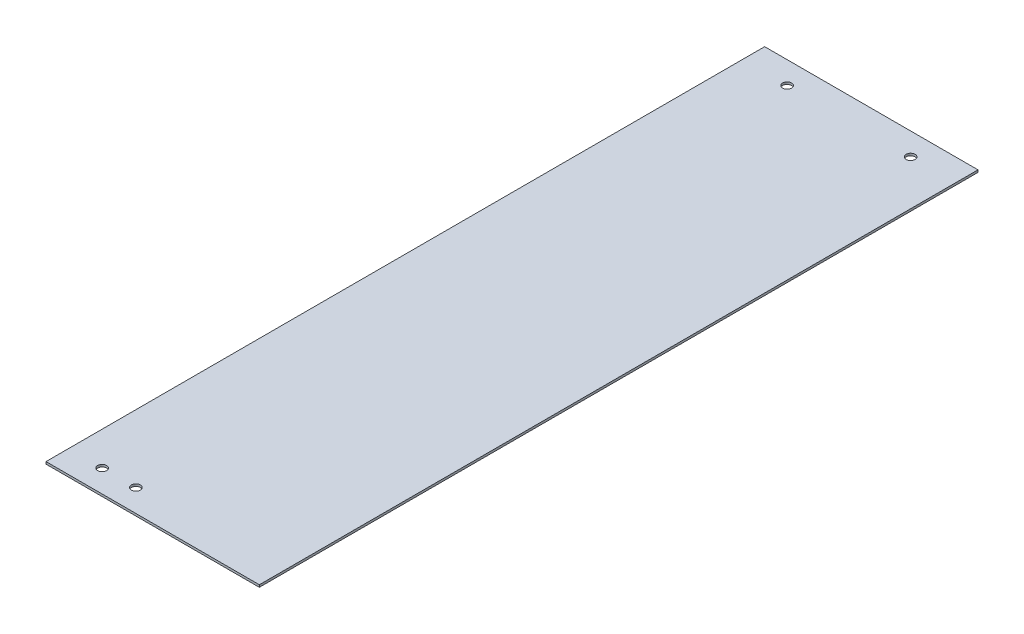
ISO-10303-21;
HEADER;
FILE_DESCRIPTION(('STEP AP214'),'2;1');
FILE_NAME('part.step','',(''),(''),'','','');
FILE_SCHEMA(('AUTOMOTIVE_DESIGN { 1 0 10303 214 1 1 1 1 }'));
ENDSEC;
DATA;
#1=APPLICATION_CONTEXT('core data for automotive mechanical design processes');
#2=APPLICATION_PROTOCOL_DEFINITION('international standard','automotive_design',2000,#1);
#3=PRODUCT_CONTEXT('',#1,'mechanical');
#4=PRODUCT('Part','Part','',(#3));
#5=PRODUCT_RELATED_PRODUCT_CATEGORY('part','',(#4));
#6=PRODUCT_DEFINITION_FORMATION('','',#4);
#7=PRODUCT_DEFINITION_CONTEXT('part definition',#1,'design');
#8=PRODUCT_DEFINITION('design','',#6,#7);
#9=PRODUCT_DEFINITION_SHAPE('','',#8);
#10=(LENGTH_UNIT() NAMED_UNIT(*) SI_UNIT(.MILLI.,.METRE.));
#11=(NAMED_UNIT(*) PLANE_ANGLE_UNIT() SI_UNIT($,.RADIAN.));
#12=(NAMED_UNIT(*) SI_UNIT($,.STERADIAN.) SOLID_ANGLE_UNIT());
#13=UNCERTAINTY_MEASURE_WITH_UNIT(LENGTH_MEASURE(1.E-05),#10,'distance_accuracy_value','');
#14=(GEOMETRIC_REPRESENTATION_CONTEXT(3) GLOBAL_UNCERTAINTY_ASSIGNED_CONTEXT((#13)) GLOBAL_UNIT_ASSIGNED_CONTEXT((#10,
#11,#12)) REPRESENTATION_CONTEXT('',''));
#15=CARTESIAN_POINT('',(0.,0.,0.));
#16=DIRECTION('',(0.,0.,1.));
#17=DIRECTION('',(1.,0.,0.));
#18=AXIS2_PLACEMENT_3D('',#15,#16,#17);
#19=CARTESIAN_POINT('',(0.,1.,0.));
#20=DIRECTION('',(0.,1.,0.));
#21=DIRECTION('',(0.,0.,1.));
#22=AXIS2_PLACEMENT_3D('',#19,#20,#21);
#23=PLANE('',#22);
#24=CARTESIAN_POINT('',(-32.5000000000001,1.,150.));
#25=DIRECTION('',(0.,1.,0.));
#26=DIRECTION('',(0.,0.,1.));
#27=AXIS2_PLACEMENT_3D('',#24,#25,#26);
#28=CIRCLE('',#27,2.);
#29=CARTESIAN_POINT('',(-32.5000000000001,1.,152.));
#30=VERTEX_POINT('',#29);
#31=EDGE_CURVE('E141',#30,#30,#28,.T.);
#32=ORIENTED_EDGE('',*,*,#31,.F.);
#33=EDGE_LOOP('',(#32));
#34=FACE_BOUND('',#33,.T.);
#35=CARTESIAN_POINT('',(-17.5000000000001,1.,150.));
#36=DIRECTION('',(0.,1.,0.));
#37=DIRECTION('',(0.,0.,1.));
#38=AXIS2_PLACEMENT_3D('',#35,#36,#37);
#39=CIRCLE('',#38,2.);
#40=CARTESIAN_POINT('',(-17.5000000000001,1.,152.));
#41=VERTEX_POINT('',#40);
#42=EDGE_CURVE('E148',#41,#41,#39,.T.);
#43=ORIENTED_EDGE('',*,*,#42,.F.);
#44=EDGE_LOOP('',(#43));
#45=FACE_BOUND('',#44,.T.);
#46=CARTESIAN_POINT('',(-27.5000000000001,1.,-150.));
#47=DIRECTION('',(0.,1.,0.));
#48=DIRECTION('',(0.,0.,1.));
#49=AXIS2_PLACEMENT_3D('',#46,#47,#48);
#50=CIRCLE('',#49,2.00000000000001);
#51=CARTESIAN_POINT('',(-27.5000000000001,1.,-148.));
#52=VERTEX_POINT('',#51);
#53=EDGE_CURVE('E111',#52,#52,#50,.T.);
#54=ORIENTED_EDGE('',*,*,#53,.F.);
#55=EDGE_LOOP('',(#54));
#56=FACE_BOUND('',#55,.T.);
#57=DIRECTION('',(0.,0.,-1.));
#58=VECTOR('',#57,1.);
#59=CARTESIAN_POINT('',(47.5,1.,-160.));
#60=LINE('',#59,#58);
#61=CARTESIAN_POINT('',(47.5000000000001,1.,160.));
#62=VERTEX_POINT('',#61);
#63=CARTESIAN_POINT('',(47.5,1.,-160.));
#64=VERTEX_POINT('',#63);
#65=EDGE_CURVE('E91',#62,#64,#60,.T.);
#66=ORIENTED_EDGE('',*,*,#65,.T.);
#67=DIRECTION('',(-1.,0.,0.));
#68=VECTOR('',#67,1.);
#69=CARTESIAN_POINT('',(-47.5000000000001,1.,-160.));
#70=LINE('',#69,#68);
#71=CARTESIAN_POINT('',(-47.5000000000001,1.,-160.));
#72=VERTEX_POINT('',#71);
#73=EDGE_CURVE('E86',#64,#72,#70,.T.);
#74=ORIENTED_EDGE('',*,*,#73,.T.);
#75=DIRECTION('',(0.,0.,1.));
#76=VECTOR('',#75,1.);
#77=CARTESIAN_POINT('',(-47.5000000000001,1.,-160.));
#78=LINE('',#77,#76);
#79=CARTESIAN_POINT('',(-47.5,1.,160.));
#80=VERTEX_POINT('',#79);
#81=EDGE_CURVE('E89',#72,#80,#78,.T.);
#82=ORIENTED_EDGE('',*,*,#81,.T.);
#83=DIRECTION('',(1.,0.,0.));
#84=VECTOR('',#83,1.);
#85=CARTESIAN_POINT('',(-47.5,1.,160.));
#86=LINE('',#85,#84);
#87=EDGE_CURVE('E56',#80,#62,#86,.T.);
#88=ORIENTED_EDGE('',*,*,#87,.T.);
#89=EDGE_LOOP('',(#66,#74,#82,#88));
#90=FACE_BOUND('',#89,.T.);
#91=CARTESIAN_POINT('',(27.5000000000001,1.,-150.));
#92=DIRECTION('',(0.,1.,0.));
#93=DIRECTION('',(0.,0.,-1.));
#94=AXIS2_PLACEMENT_3D('',#91,#92,#93);
#95=CIRCLE('',#94,2.00000000000001);
#96=CARTESIAN_POINT('',(27.5000000000001,1.,-152.));
#97=VERTEX_POINT('',#96);
#98=EDGE_CURVE('E133',#97,#97,#95,.T.);
#99=ORIENTED_EDGE('',*,*,#98,.F.);
#100=EDGE_LOOP('',(#99));
#101=FACE_BOUND('',#100,.T.);
#102=ADVANCED_FACE('F38',(#34,#45,#56,#90,#101),#23,.T.);
#103=CARTESIAN_POINT('',(0.,0.,0.));
#104=DIRECTION('',(0.,1.,0.));
#105=DIRECTION('',(0.,0.,1.));
#106=AXIS2_PLACEMENT_3D('',#103,#104,#105);
#107=PLANE('',#106);
#108=CARTESIAN_POINT('',(-32.5000000000001,0.,150.));
#109=DIRECTION('',(0.,1.,0.));
#110=DIRECTION('',(0.,0.,1.));
#111=AXIS2_PLACEMENT_3D('',#108,#109,#110);
#112=CIRCLE('',#111,2.);
#113=CARTESIAN_POINT('',(-32.5000000000001,0.,152.));
#114=VERTEX_POINT('',#113);
#115=EDGE_CURVE('E152',#114,#114,#112,.T.);
#116=ORIENTED_EDGE('',*,*,#115,.T.);
#117=EDGE_LOOP('',(#116));
#118=FACE_BOUND('',#117,.T.);
#119=CARTESIAN_POINT('',(-17.5000000000001,0.,150.));
#120=DIRECTION('',(0.,1.,0.));
#121=DIRECTION('',(0.,0.,1.));
#122=AXIS2_PLACEMENT_3D('',#119,#120,#121);
#123=CIRCLE('',#122,2.);
#124=CARTESIAN_POINT('',(-17.5000000000001,0.,152.));
#125=VERTEX_POINT('',#124);
#126=EDGE_CURVE('E153',#125,#125,#123,.T.);
#127=ORIENTED_EDGE('',*,*,#126,.T.);
#128=EDGE_LOOP('',(#127));
#129=FACE_BOUND('',#128,.T.);
#130=DIRECTION('',(0.,0.,-1.));
#131=VECTOR('',#130,1.);
#132=CARTESIAN_POINT('',(47.5,0.,-160.));
#133=LINE('',#132,#131);
#134=CARTESIAN_POINT('',(47.5000000000001,0.,160.));
#135=VERTEX_POINT('',#134);
#136=CARTESIAN_POINT('',(47.5,0.,-160.));
#137=VERTEX_POINT('',#136);
#138=EDGE_CURVE('E107',#135,#137,#133,.T.);
#139=ORIENTED_EDGE('',*,*,#138,.F.);
#140=DIRECTION('',(1.,0.,0.));
#141=VECTOR('',#140,1.);
#142=CARTESIAN_POINT('',(-47.5,0.,160.));
#143=LINE('',#142,#141);
#144=CARTESIAN_POINT('',(-47.5,0.,160.));
#145=VERTEX_POINT('',#144);
#146=EDGE_CURVE('E79',#145,#135,#143,.T.);
#147=ORIENTED_EDGE('',*,*,#146,.F.);
#148=DIRECTION('',(0.,0.,1.));
#149=VECTOR('',#148,1.);
#150=CARTESIAN_POINT('',(-47.5000000000001,0.,-160.));
#151=LINE('',#150,#149);
#152=CARTESIAN_POINT('',(-47.5000000000001,0.,-160.));
#153=VERTEX_POINT('',#152);
#154=EDGE_CURVE('E73',#153,#145,#151,.T.);
#155=ORIENTED_EDGE('',*,*,#154,.F.);
#156=DIRECTION('',(-1.,0.,0.));
#157=VECTOR('',#156,1.);
#158=CARTESIAN_POINT('',(-47.5000000000001,0.,-160.));
#159=LINE('',#158,#157);
#160=EDGE_CURVE('E96',#137,#153,#159,.T.);
#161=ORIENTED_EDGE('',*,*,#160,.F.);
#162=EDGE_LOOP('',(#139,#147,#155,#161));
#163=FACE_BOUND('',#162,.T.);
#164=CARTESIAN_POINT('',(-27.5000000000001,0.,-150.));
#165=DIRECTION('',(0.,1.,0.));
#166=DIRECTION('',(0.,0.,1.));
#167=AXIS2_PLACEMENT_3D('',#164,#165,#166);
#168=CIRCLE('',#167,2.00000000000001);
#169=CARTESIAN_POINT('',(-27.5000000000001,0.,-148.));
#170=VERTEX_POINT('',#169);
#171=EDGE_CURVE('E129',#170,#170,#168,.T.);
#172=ORIENTED_EDGE('',*,*,#171,.T.);
#173=EDGE_LOOP('',(#172));
#174=FACE_BOUND('',#173,.T.);
#175=CARTESIAN_POINT('',(27.5000000000001,0.,-150.));
#176=DIRECTION('',(0.,1.,0.));
#177=DIRECTION('',(0.,0.,-1.));
#178=AXIS2_PLACEMENT_3D('',#175,#176,#177);
#179=CIRCLE('',#178,2.00000000000001);
#180=CARTESIAN_POINT('',(27.5000000000001,0.,-152.));
#181=VERTEX_POINT('',#180);
#182=EDGE_CURVE('E137',#181,#181,#179,.T.);
#183=ORIENTED_EDGE('',*,*,#182,.T.);
#184=EDGE_LOOP('',(#183));
#185=FACE_BOUND('',#184,.T.);
#186=ADVANCED_FACE('F124',(#118,#129,#163,#174,#185),#107,.F.);
#187=CARTESIAN_POINT('',(47.5,1.,-160.));
#188=DIRECTION('',(-1.,0.,0.));
#189=DIRECTION('',(0.,0.,1.));
#190=AXIS2_PLACEMENT_3D('',#187,#188,#189);
#191=PLANE('',#190);
#192=ORIENTED_EDGE('',*,*,#138,.T.);
#193=DIRECTION('',(0.,-1.,0.));
#194=VECTOR('',#193,1.);
#195=CARTESIAN_POINT('',(47.5,1.,-160.));
#196=LINE('',#195,#194);
#197=EDGE_CURVE('E11',#64,#137,#196,.T.);
#198=ORIENTED_EDGE('',*,*,#197,.F.);
#199=ORIENTED_EDGE('',*,*,#65,.F.);
#200=DIRECTION('',(0.,-1.,0.));
#201=VECTOR('',#200,1.);
#202=CARTESIAN_POINT('',(47.5000000000001,1.,160.));
#203=LINE('',#202,#201);
#204=EDGE_CURVE('E103',#62,#135,#203,.T.);
#205=ORIENTED_EDGE('',*,*,#204,.T.);
#206=EDGE_LOOP('',(#192,#198,#199,#205));
#207=FACE_BOUND('',#206,.T.);
#208=ADVANCED_FACE('F40',(#207),#191,.F.);
#209=CARTESIAN_POINT('',(-47.5000000000001,1.,-160.));
#210=DIRECTION('',(0.,0.,1.));
#211=DIRECTION('',(1.,0.,0.));
#212=AXIS2_PLACEMENT_3D('',#209,#210,#211);
#213=PLANE('',#212);
#214=ORIENTED_EDGE('',*,*,#160,.T.);
#215=DIRECTION('',(0.,-1.,0.));
#216=VECTOR('',#215,1.);
#217=CARTESIAN_POINT('',(-47.5000000000001,1.,-160.));
#218=LINE('',#217,#216);
#219=EDGE_CURVE('E48',#72,#153,#218,.T.);
#220=ORIENTED_EDGE('',*,*,#219,.F.);
#221=ORIENTED_EDGE('',*,*,#73,.F.);
#222=ORIENTED_EDGE('',*,*,#197,.T.);
#223=EDGE_LOOP('',(#214,#220,#221,#222));
#224=FACE_BOUND('',#223,.T.);
#225=ADVANCED_FACE('F95',(#224),#213,.F.);
#226=CARTESIAN_POINT('',(-47.5000000000001,1.,-160.));
#227=DIRECTION('',(1.,0.,0.));
#228=DIRECTION('',(0.,0.,-1.));
#229=AXIS2_PLACEMENT_3D('',#226,#227,#228);
#230=PLANE('',#229);
#231=ORIENTED_EDGE('',*,*,#154,.T.);
#232=DIRECTION('',(0.,-1.,0.));
#233=VECTOR('',#232,1.);
#234=CARTESIAN_POINT('',(-47.5,1.,160.));
#235=LINE('',#234,#233);
#236=EDGE_CURVE('E98',#80,#145,#235,.T.);
#237=ORIENTED_EDGE('',*,*,#236,.F.);
#238=ORIENTED_EDGE('',*,*,#81,.F.);
#239=ORIENTED_EDGE('',*,*,#219,.T.);
#240=EDGE_LOOP('',(#231,#237,#238,#239));
#241=FACE_BOUND('',#240,.T.);
#242=ADVANCED_FACE('F99',(#241),#230,.F.);
#243=CARTESIAN_POINT('',(-47.5,1.,160.));
#244=DIRECTION('',(0.,0.,-1.));
#245=DIRECTION('',(-1.,0.,0.));
#246=AXIS2_PLACEMENT_3D('',#243,#244,#245);
#247=PLANE('',#246);
#248=ORIENTED_EDGE('',*,*,#146,.T.);
#249=ORIENTED_EDGE('',*,*,#204,.F.);
#250=ORIENTED_EDGE('',*,*,#87,.F.);
#251=ORIENTED_EDGE('',*,*,#236,.T.);
#252=EDGE_LOOP('',(#248,#249,#250,#251));
#253=FACE_BOUND('',#252,.T.);
#254=ADVANCED_FACE('F121',(#253),#247,.F.);
#255=CARTESIAN_POINT('',(-27.5000000000001,1.,-150.));
#256=DIRECTION('',(0.,-1.,0.));
#257=DIRECTION('',(0.,0.,-1.));
#258=AXIS2_PLACEMENT_3D('',#255,#256,#257);
#259=CYLINDRICAL_SURFACE('',#258,2.00000000000001);
#260=ORIENTED_EDGE('',*,*,#53,.T.);
#261=EDGE_LOOP('',(#260));
#262=FACE_BOUND('',#261,.T.);
#263=ORIENTED_EDGE('',*,*,#171,.F.);
#264=EDGE_LOOP('',(#263));
#265=FACE_BOUND('',#264,.T.);
#266=ADVANCED_FACE('F185',(#262,#265),#259,.F.);
#267=CARTESIAN_POINT('',(27.5000000000001,1.,-150.));
#268=DIRECTION('',(0.,-1.,0.));
#269=DIRECTION('',(0.,0.,-1.));
#270=AXIS2_PLACEMENT_3D('',#267,#268,#269);
#271=CYLINDRICAL_SURFACE('',#270,2.00000000000001);
#272=ORIENTED_EDGE('',*,*,#98,.T.);
#273=EDGE_LOOP('',(#272));
#274=FACE_BOUND('',#273,.T.);
#275=ORIENTED_EDGE('',*,*,#182,.F.);
#276=EDGE_LOOP('',(#275));
#277=FACE_BOUND('',#276,.T.);
#278=ADVANCED_FACE('F171',(#274,#277),#271,.F.);
#279=CARTESIAN_POINT('',(-17.5000000000001,0.,150.));
#280=DIRECTION('',(0.,1.,0.));
#281=DIRECTION('',(0.,0.,1.));
#282=AXIS2_PLACEMENT_3D('',#279,#280,#281);
#283=CYLINDRICAL_SURFACE('',#282,2.);
#284=ORIENTED_EDGE('',*,*,#42,.T.);
#285=EDGE_LOOP('',(#284));
#286=FACE_BOUND('',#285,.T.);
#287=ORIENTED_EDGE('',*,*,#126,.F.);
#288=EDGE_LOOP('',(#287));
#289=FACE_BOUND('',#288,.T.);
#290=ADVANCED_FACE('F165',(#286,#289),#283,.F.);
#291=CARTESIAN_POINT('',(-32.5000000000001,0.,150.));
#292=DIRECTION('',(0.,1.,0.));
#293=DIRECTION('',(0.,0.,1.));
#294=AXIS2_PLACEMENT_3D('',#291,#292,#293);
#295=CYLINDRICAL_SURFACE('',#294,2.);
#296=ORIENTED_EDGE('',*,*,#31,.T.);
#297=EDGE_LOOP('',(#296));
#298=FACE_BOUND('',#297,.T.);
#299=ORIENTED_EDGE('',*,*,#115,.F.);
#300=EDGE_LOOP('',(#299));
#301=FACE_BOUND('',#300,.T.);
#302=ADVANCED_FACE('F163',(#298,#301),#295,.F.);
#303=CLOSED_SHELL('',(#102,#186,#208,#225,#242,#254,#266,#278,#290,#302));
#304=MANIFOLD_SOLID_BREP('B2',#303);
#305=ADVANCED_BREP_SHAPE_REPRESENTATION('',(#18,#304),#14);
#306=SHAPE_DEFINITION_REPRESENTATION(#9,#305);
ENDSEC;
END-ISO-10303-21;
